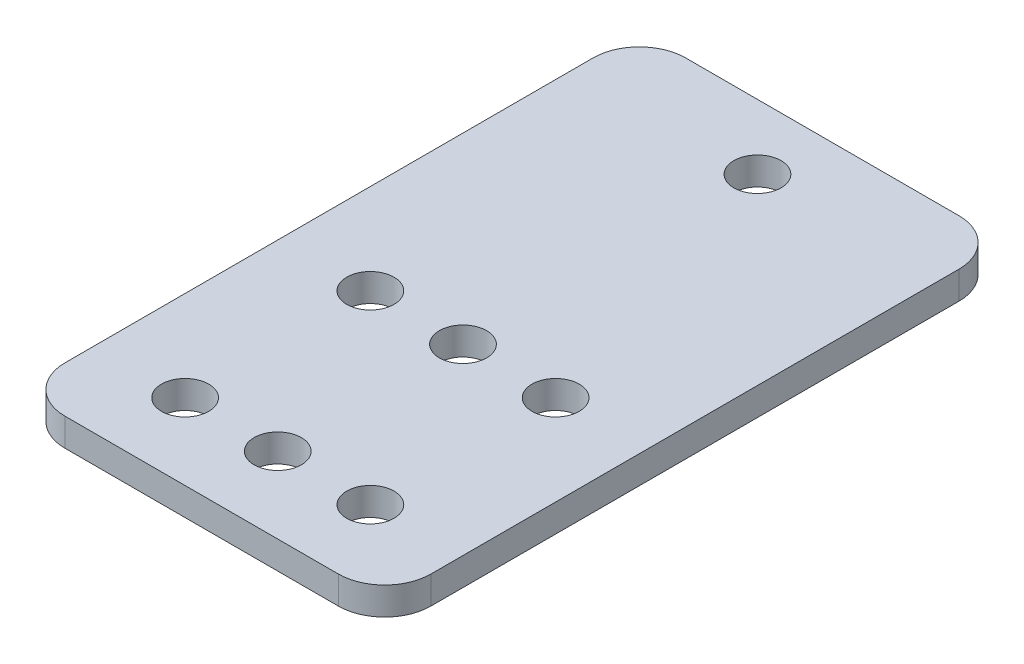
ISO-10303-21;
HEADER;
FILE_DESCRIPTION(('STEP AP214'),'2;1');
FILE_NAME('part.step','',(''),(''),'','','');
FILE_SCHEMA(('AUTOMOTIVE_DESIGN { 1 0 10303 214 1 1 1 1 }'));
ENDSEC;
DATA;
#1=APPLICATION_CONTEXT('core data for automotive mechanical design processes');
#2=APPLICATION_PROTOCOL_DEFINITION('international standard','automotive_design',2000,#1);
#3=PRODUCT_CONTEXT('',#1,'mechanical');
#4=PRODUCT('Part','Part','',(#3));
#5=PRODUCT_RELATED_PRODUCT_CATEGORY('part','',(#4));
#6=PRODUCT_DEFINITION_FORMATION('','',#4);
#7=PRODUCT_DEFINITION_CONTEXT('part definition',#1,'design');
#8=PRODUCT_DEFINITION('design','',#6,#7);
#9=PRODUCT_DEFINITION_SHAPE('','',#8);
#10=(LENGTH_UNIT() NAMED_UNIT(*) SI_UNIT(.MILLI.,.METRE.));
#11=(NAMED_UNIT(*) PLANE_ANGLE_UNIT() SI_UNIT($,.RADIAN.));
#12=(NAMED_UNIT(*) SI_UNIT($,.STERADIAN.) SOLID_ANGLE_UNIT());
#13=UNCERTAINTY_MEASURE_WITH_UNIT(LENGTH_MEASURE(1.E-05),#10,'distance_accuracy_value','');
#14=(GEOMETRIC_REPRESENTATION_CONTEXT(3) GLOBAL_UNCERTAINTY_ASSIGNED_CONTEXT((#13)) GLOBAL_UNIT_ASSIGNED_CONTEXT((#10,
#11,#12)) REPRESENTATION_CONTEXT('',''));
#15=CARTESIAN_POINT('',(0.,0.,0.));
#16=DIRECTION('',(0.,0.,1.));
#17=DIRECTION('',(1.,0.,0.));
#18=AXIS2_PLACEMENT_3D('',#15,#16,#17);
#19=CARTESIAN_POINT('',(-14.75,3.,28.5));
#20=DIRECTION('',(0.,-1.,0.));
#21=DIRECTION('',(0.,0.,-1.));
#22=AXIS2_PLACEMENT_3D('',#19,#20,#21);
#23=PLANE('',#22);
#24=CARTESIAN_POINT('',(-9.99999999999999,3.,25.29));
#25=DIRECTION('',(0.,1.,0.));
#26=DIRECTION('',(0.,0.,1.));
#27=AXIS2_PLACEMENT_3D('',#24,#25,#26);
#28=CIRCLE('',#27,2.55);
#29=CARTESIAN_POINT('',(-9.99999999999999,3.,27.84));
#30=VERTEX_POINT('',#29);
#31=EDGE_CURVE('E211',#30,#30,#28,.T.);
#32=ORIENTED_EDGE('',*,*,#31,.F.);
#33=EDGE_LOOP('',(#32));
#34=FACE_BOUND('',#33,.T.);
#35=CARTESIAN_POINT('',(0.,3.,25.29));
#36=DIRECTION('',(0.,1.,0.));
#37=DIRECTION('',(0.,0.,1.));
#38=AXIS2_PLACEMENT_3D('',#35,#36,#37);
#39=CIRCLE('',#38,2.55);
#40=CARTESIAN_POINT('',(0.,3.,27.84));
#41=VERTEX_POINT('',#40);
#42=EDGE_CURVE('E199',#41,#41,#39,.T.);
#43=ORIENTED_EDGE('',*,*,#42,.F.);
#44=EDGE_LOOP('',(#43));
#45=FACE_BOUND('',#44,.T.);
#46=CARTESIAN_POINT('',(10.,3.,25.29));
#47=DIRECTION('',(0.,1.,0.));
#48=DIRECTION('',(0.,0.,1.));
#49=AXIS2_PLACEMENT_3D('',#46,#47,#48);
#50=CIRCLE('',#49,2.55);
#51=CARTESIAN_POINT('',(10.,3.,27.84));
#52=VERTEX_POINT('',#51);
#53=EDGE_CURVE('E187',#52,#52,#50,.T.);
#54=ORIENTED_EDGE('',*,*,#53,.F.);
#55=EDGE_LOOP('',(#54));
#56=FACE_BOUND('',#55,.T.);
#57=CARTESIAN_POINT('',(-14.75,3.,28.5));
#58=DIRECTION('',(0.,1.,0.));
#59=DIRECTION('',(0.,0.,-1.));
#60=AXIS2_PLACEMENT_3D('',#57,#58,#59);
#61=CIRCLE('',#60,5.);
#62=CARTESIAN_POINT('',(-19.75,3.,28.5));
#63=VERTEX_POINT('',#62);
#64=CARTESIAN_POINT('',(-14.75,3.,33.5));
#65=VERTEX_POINT('',#64);
#66=EDGE_CURVE('E150',#63,#65,#61,.T.);
#67=ORIENTED_EDGE('',*,*,#66,.T.);
#68=DIRECTION('',(1.,0.,0.));
#69=VECTOR('',#68,1.);
#70=CARTESIAN_POINT('',(14.75,3.,33.5));
#71=LINE('',#70,#69);
#72=CARTESIAN_POINT('',(14.75,3.,33.5));
#73=VERTEX_POINT('',#72);
#74=EDGE_CURVE('E98',#65,#73,#71,.T.);
#75=ORIENTED_EDGE('',*,*,#74,.T.);
#76=CARTESIAN_POINT('',(14.75,3.,28.5));
#77=DIRECTION('',(0.,1.,0.));
#78=DIRECTION('',(0.,0.,1.));
#79=AXIS2_PLACEMENT_3D('',#76,#77,#78);
#80=CIRCLE('',#79,5.00000000000001);
#81=CARTESIAN_POINT('',(19.75,3.,28.5));
#82=VERTEX_POINT('',#81);
#83=EDGE_CURVE('E165',#73,#82,#80,.T.);
#84=ORIENTED_EDGE('',*,*,#83,.T.);
#85=DIRECTION('',(0.,0.,-1.));
#86=VECTOR('',#85,1.);
#87=CARTESIAN_POINT('',(19.75,3.,28.5));
#88=LINE('',#87,#86);
#89=CARTESIAN_POINT('',(19.75,3.,-28.5));
#90=VERTEX_POINT('',#89);
#91=EDGE_CURVE('E178',#82,#90,#88,.T.);
#92=ORIENTED_EDGE('',*,*,#91,.T.);
#93=CARTESIAN_POINT('',(14.75,3.,-28.5));
#94=DIRECTION('',(0.,1.,0.));
#95=DIRECTION('',(0.,0.,1.));
#96=AXIS2_PLACEMENT_3D('',#93,#94,#95);
#97=CIRCLE('',#96,5.);
#98=CARTESIAN_POINT('',(14.75,3.,-33.5));
#99=VERTEX_POINT('',#98);
#100=EDGE_CURVE('E117',#90,#99,#97,.T.);
#101=ORIENTED_EDGE('',*,*,#100,.T.);
#102=DIRECTION('',(-1.,0.,0.));
#103=VECTOR('',#102,1.);
#104=CARTESIAN_POINT('',(14.75,3.,-33.5));
#105=LINE('',#104,#103);
#106=CARTESIAN_POINT('',(-14.75,3.,-33.5));
#107=VERTEX_POINT('',#106);
#108=EDGE_CURVE('E111',#99,#107,#105,.T.);
#109=ORIENTED_EDGE('',*,*,#108,.T.);
#110=CARTESIAN_POINT('',(-14.75,3.,-28.5));
#111=DIRECTION('',(0.,1.,0.));
#112=DIRECTION('',(0.,0.,1.));
#113=AXIS2_PLACEMENT_3D('',#110,#111,#112);
#114=CIRCLE('',#113,5.);
#115=CARTESIAN_POINT('',(-19.75,3.,-28.5));
#116=VERTEX_POINT('',#115);
#117=EDGE_CURVE('E115',#107,#116,#114,.T.);
#118=ORIENTED_EDGE('',*,*,#117,.T.);
#119=DIRECTION('',(0.,0.,1.));
#120=VECTOR('',#119,1.);
#121=CARTESIAN_POINT('',(-19.75,3.,28.5));
#122=LINE('',#121,#120);
#123=EDGE_CURVE('E55',#116,#63,#122,.T.);
#124=ORIENTED_EDGE('',*,*,#123,.T.);
#125=EDGE_LOOP('',(#67,#75,#84,#92,#101,#109,#118,#124));
#126=FACE_BOUND('',#125,.T.);
#127=CARTESIAN_POINT('',(0.,3.,-26.5));
#128=DIRECTION('',(0.,1.,0.));
#129=DIRECTION('',(0.,0.,1.));
#130=AXIS2_PLACEMENT_3D('',#127,#128,#129);
#131=CIRCLE('',#130,2.55);
#132=CARTESIAN_POINT('',(0.,3.,-23.95));
#133=VERTEX_POINT('',#132);
#134=EDGE_CURVE('E139',#133,#133,#131,.T.);
#135=ORIENTED_EDGE('',*,*,#134,.F.);
#136=EDGE_LOOP('',(#135));
#137=FACE_BOUND('',#136,.T.);
#138=CARTESIAN_POINT('',(10.,3.,5.29));
#139=DIRECTION('',(0.,1.,0.));
#140=DIRECTION('',(0.,0.,1.));
#141=AXIS2_PLACEMENT_3D('',#138,#139,#140);
#142=CIRCLE('',#141,2.55);
#143=CARTESIAN_POINT('',(10.,3.,7.84));
#144=VERTEX_POINT('',#143);
#145=EDGE_CURVE('E193',#144,#144,#142,.T.);
#146=ORIENTED_EDGE('',*,*,#145,.F.);
#147=EDGE_LOOP('',(#146));
#148=FACE_BOUND('',#147,.T.);
#149=CARTESIAN_POINT('',(0.,3.,5.29));
#150=DIRECTION('',(0.,1.,0.));
#151=DIRECTION('',(0.,0.,1.));
#152=AXIS2_PLACEMENT_3D('',#149,#150,#151);
#153=CIRCLE('',#152,2.55);
#154=CARTESIAN_POINT('',(0.,3.,7.84));
#155=VERTEX_POINT('',#154);
#156=EDGE_CURVE('E205',#155,#155,#153,.T.);
#157=ORIENTED_EDGE('',*,*,#156,.F.);
#158=EDGE_LOOP('',(#157));
#159=FACE_BOUND('',#158,.T.);
#160=CARTESIAN_POINT('',(-9.99999999999999,3.,5.29));
#161=DIRECTION('',(0.,1.,0.));
#162=DIRECTION('',(0.,0.,1.));
#163=AXIS2_PLACEMENT_3D('',#160,#161,#162);
#164=CIRCLE('',#163,2.55);
#165=CARTESIAN_POINT('',(-9.99999999999999,3.,7.84));
#166=VERTEX_POINT('',#165);
#167=EDGE_CURVE('E217',#166,#166,#164,.T.);
#168=ORIENTED_EDGE('',*,*,#167,.F.);
#169=EDGE_LOOP('',(#168));
#170=FACE_BOUND('',#169,.T.);
#171=ADVANCED_FACE('F38',(#34,#45,#56,#126,#137,#148,#159,#170),#23,.F.);
#172=CARTESIAN_POINT('',(-14.75,0.,28.5));
#173=DIRECTION('',(0.,-1.,0.));
#174=DIRECTION('',(0.,0.,-1.));
#175=AXIS2_PLACEMENT_3D('',#172,#173,#174);
#176=PLANE('',#175);
#177=CARTESIAN_POINT('',(-9.99999999999999,0.,25.29));
#178=DIRECTION('',(0.,1.,0.));
#179=DIRECTION('',(0.,0.,1.));
#180=AXIS2_PLACEMENT_3D('',#177,#178,#179);
#181=CIRCLE('',#180,2.55);
#182=CARTESIAN_POINT('',(-9.99999999999999,0.,27.84));
#183=VERTEX_POINT('',#182);
#184=EDGE_CURVE('E214',#183,#183,#181,.T.);
#185=ORIENTED_EDGE('',*,*,#184,.T.);
#186=EDGE_LOOP('',(#185));
#187=FACE_BOUND('',#186,.T.);
#188=CARTESIAN_POINT('',(0.,0.,25.29));
#189=DIRECTION('',(0.,1.,0.));
#190=DIRECTION('',(0.,0.,1.));
#191=AXIS2_PLACEMENT_3D('',#188,#189,#190);
#192=CIRCLE('',#191,2.55);
#193=CARTESIAN_POINT('',(0.,0.,27.84));
#194=VERTEX_POINT('',#193);
#195=EDGE_CURVE('E202',#194,#194,#192,.T.);
#196=ORIENTED_EDGE('',*,*,#195,.T.);
#197=EDGE_LOOP('',(#196));
#198=FACE_BOUND('',#197,.T.);
#199=CARTESIAN_POINT('',(10.,0.,25.29));
#200=DIRECTION('',(0.,1.,0.));
#201=DIRECTION('',(0.,0.,1.));
#202=AXIS2_PLACEMENT_3D('',#199,#200,#201);
#203=CIRCLE('',#202,2.55);
#204=CARTESIAN_POINT('',(10.,0.,27.84));
#205=VERTEX_POINT('',#204);
#206=EDGE_CURVE('E190',#205,#205,#203,.T.);
#207=ORIENTED_EDGE('',*,*,#206,.T.);
#208=EDGE_LOOP('',(#207));
#209=FACE_BOUND('',#208,.T.);
#210=CARTESIAN_POINT('',(-14.75,0.,28.5));
#211=DIRECTION('',(0.,1.,0.));
#212=DIRECTION('',(0.,0.,-1.));
#213=AXIS2_PLACEMENT_3D('',#210,#211,#212);
#214=CIRCLE('',#213,5.);
#215=CARTESIAN_POINT('',(-19.75,0.,28.5));
#216=VERTEX_POINT('',#215);
#217=CARTESIAN_POINT('',(-14.75,0.,33.5));
#218=VERTEX_POINT('',#217);
#219=EDGE_CURVE('E135',#216,#218,#214,.T.);
#220=ORIENTED_EDGE('',*,*,#219,.F.);
#221=DIRECTION('',(0.,0.,1.));
#222=VECTOR('',#221,1.);
#223=CARTESIAN_POINT('',(-19.75,0.,28.5));
#224=LINE('',#223,#222);
#225=CARTESIAN_POINT('',(-19.75,0.,-28.5));
#226=VERTEX_POINT('',#225);
#227=EDGE_CURVE('E90',#226,#216,#224,.T.);
#228=ORIENTED_EDGE('',*,*,#227,.F.);
#229=CARTESIAN_POINT('',(-14.75,0.,-28.5));
#230=DIRECTION('',(0.,1.,0.));
#231=DIRECTION('',(0.,0.,1.));
#232=AXIS2_PLACEMENT_3D('',#229,#230,#231);
#233=CIRCLE('',#232,5.);
#234=CARTESIAN_POINT('',(-14.75,0.,-33.5));
#235=VERTEX_POINT('',#234);
#236=EDGE_CURVE('E84',#235,#226,#233,.T.);
#237=ORIENTED_EDGE('',*,*,#236,.F.);
#238=DIRECTION('',(-1.,0.,0.));
#239=VECTOR('',#238,1.);
#240=CARTESIAN_POINT('',(14.75,0.,-33.5));
#241=LINE('',#240,#239);
#242=CARTESIAN_POINT('',(14.75,0.,-33.5));
#243=VERTEX_POINT('',#242);
#244=EDGE_CURVE('E125',#243,#235,#241,.T.);
#245=ORIENTED_EDGE('',*,*,#244,.F.);
#246=CARTESIAN_POINT('',(14.75,0.,-28.5));
#247=DIRECTION('',(0.,1.,0.));
#248=DIRECTION('',(0.,0.,1.));
#249=AXIS2_PLACEMENT_3D('',#246,#247,#248);
#250=CIRCLE('',#249,5.);
#251=CARTESIAN_POINT('',(19.75,0.,-28.5));
#252=VERTEX_POINT('',#251);
#253=EDGE_CURVE('E145',#252,#243,#250,.T.);
#254=ORIENTED_EDGE('',*,*,#253,.F.);
#255=DIRECTION('',(0.,0.,-1.));
#256=VECTOR('',#255,1.);
#257=CARTESIAN_POINT('',(19.75,0.,28.5));
#258=LINE('',#257,#256);
#259=CARTESIAN_POINT('',(19.75,0.,28.5));
#260=VERTEX_POINT('',#259);
#261=EDGE_CURVE('E143',#260,#252,#258,.T.);
#262=ORIENTED_EDGE('',*,*,#261,.F.);
#263=CARTESIAN_POINT('',(14.75,0.,28.5));
#264=DIRECTION('',(0.,1.,0.));
#265=DIRECTION('',(0.,0.,1.));
#266=AXIS2_PLACEMENT_3D('',#263,#264,#265);
#267=CIRCLE('',#266,5.00000000000001);
#268=CARTESIAN_POINT('',(14.75,0.,33.5));
#269=VERTEX_POINT('',#268);
#270=EDGE_CURVE('E141',#269,#260,#267,.T.);
#271=ORIENTED_EDGE('',*,*,#270,.F.);
#272=DIRECTION('',(1.,0.,0.));
#273=VECTOR('',#272,1.);
#274=CARTESIAN_POINT('',(14.75,0.,33.5));
#275=LINE('',#274,#273);
#276=EDGE_CURVE('E138',#218,#269,#275,.T.);
#277=ORIENTED_EDGE('',*,*,#276,.F.);
#278=EDGE_LOOP('',(#220,#228,#237,#245,#254,#262,#271,#277));
#279=FACE_BOUND('',#278,.T.);
#280=CARTESIAN_POINT('',(0.,0.,-26.5));
#281=DIRECTION('',(0.,1.,0.));
#282=DIRECTION('',(0.,0.,1.));
#283=AXIS2_PLACEMENT_3D('',#280,#281,#282);
#284=CIRCLE('',#283,2.55);
#285=CARTESIAN_POINT('',(0.,0.,-23.95));
#286=VERTEX_POINT('',#285);
#287=EDGE_CURVE('E184',#286,#286,#284,.T.);
#288=ORIENTED_EDGE('',*,*,#287,.T.);
#289=EDGE_LOOP('',(#288));
#290=FACE_BOUND('',#289,.T.);
#291=CARTESIAN_POINT('',(10.,0.,5.29));
#292=DIRECTION('',(0.,1.,0.));
#293=DIRECTION('',(0.,0.,1.));
#294=AXIS2_PLACEMENT_3D('',#291,#292,#293);
#295=CIRCLE('',#294,2.55);
#296=CARTESIAN_POINT('',(10.,0.,7.84));
#297=VERTEX_POINT('',#296);
#298=EDGE_CURVE('E196',#297,#297,#295,.T.);
#299=ORIENTED_EDGE('',*,*,#298,.T.);
#300=EDGE_LOOP('',(#299));
#301=FACE_BOUND('',#300,.T.);
#302=CARTESIAN_POINT('',(0.,0.,5.29));
#303=DIRECTION('',(0.,1.,0.));
#304=DIRECTION('',(0.,0.,1.));
#305=AXIS2_PLACEMENT_3D('',#302,#303,#304);
#306=CIRCLE('',#305,2.55);
#307=CARTESIAN_POINT('',(0.,0.,7.84));
#308=VERTEX_POINT('',#307);
#309=EDGE_CURVE('E208',#308,#308,#306,.T.);
#310=ORIENTED_EDGE('',*,*,#309,.T.);
#311=EDGE_LOOP('',(#310));
#312=FACE_BOUND('',#311,.T.);
#313=CARTESIAN_POINT('',(-9.99999999999999,0.,5.29));
#314=DIRECTION('',(0.,1.,0.));
#315=DIRECTION('',(0.,0.,1.));
#316=AXIS2_PLACEMENT_3D('',#313,#314,#315);
#317=CIRCLE('',#316,2.55);
#318=CARTESIAN_POINT('',(-9.99999999999999,0.,7.84));
#319=VERTEX_POINT('',#318);
#320=EDGE_CURVE('E220',#319,#319,#317,.T.);
#321=ORIENTED_EDGE('',*,*,#320,.T.);
#322=EDGE_LOOP('',(#321));
#323=FACE_BOUND('',#322,.T.);
#324=ADVANCED_FACE('F169',(#187,#198,#209,#279,#290,#301,#312,#323),#176,.T.);
#325=CARTESIAN_POINT('',(-14.75,3.,28.5));
#326=DIRECTION('',(0.,-1.,0.));
#327=DIRECTION('',(0.,0.,-1.));
#328=AXIS2_PLACEMENT_3D('',#325,#326,#327);
#329=CYLINDRICAL_SURFACE('',#328,5.);
#330=ORIENTED_EDGE('',*,*,#219,.T.);
#331=DIRECTION('',(0.,-1.,0.));
#332=VECTOR('',#331,1.);
#333=CARTESIAN_POINT('',(-14.75,3.,33.5));
#334=LINE('',#333,#332);
#335=EDGE_CURVE('E11',#65,#218,#334,.T.);
#336=ORIENTED_EDGE('',*,*,#335,.F.);
#337=ORIENTED_EDGE('',*,*,#66,.F.);
#338=DIRECTION('',(0.,-1.,0.));
#339=VECTOR('',#338,1.);
#340=CARTESIAN_POINT('',(-19.75,3.,28.5));
#341=LINE('',#340,#339);
#342=EDGE_CURVE('E131',#63,#216,#341,.T.);
#343=ORIENTED_EDGE('',*,*,#342,.T.);
#344=EDGE_LOOP('',(#330,#336,#337,#343));
#345=FACE_BOUND('',#344,.T.);
#346=ADVANCED_FACE('F40',(#345),#329,.T.);
#347=CARTESIAN_POINT('',(14.75,3.,33.5));
#348=DIRECTION('',(0.,0.,-1.));
#349=DIRECTION('',(-1.,0.,0.));
#350=AXIS2_PLACEMENT_3D('',#347,#348,#349);
#351=PLANE('',#350);
#352=ORIENTED_EDGE('',*,*,#276,.T.);
#353=DIRECTION('',(0.,-1.,0.));
#354=VECTOR('',#353,1.);
#355=CARTESIAN_POINT('',(14.75,3.,33.5));
#356=LINE('',#355,#354);
#357=EDGE_CURVE('E47',#73,#269,#356,.T.);
#358=ORIENTED_EDGE('',*,*,#357,.F.);
#359=ORIENTED_EDGE('',*,*,#74,.F.);
#360=ORIENTED_EDGE('',*,*,#335,.T.);
#361=EDGE_LOOP('',(#352,#358,#359,#360));
#362=FACE_BOUND('',#361,.T.);
#363=ADVANCED_FACE('F255',(#362),#351,.F.);
#364=CARTESIAN_POINT('',(14.75,3.,28.5));
#365=DIRECTION('',(0.,-1.,0.));
#366=DIRECTION('',(0.,0.,-1.));
#367=AXIS2_PLACEMENT_3D('',#364,#365,#366);
#368=CYLINDRICAL_SURFACE('',#367,5.00000000000001);
#369=ORIENTED_EDGE('',*,*,#270,.T.);
#370=DIRECTION('',(0.,-1.,0.));
#371=VECTOR('',#370,1.);
#372=CARTESIAN_POINT('',(19.75,3.,28.5));
#373=LINE('',#372,#371);
#374=EDGE_CURVE('E157',#82,#260,#373,.T.);
#375=ORIENTED_EDGE('',*,*,#374,.F.);
#376=ORIENTED_EDGE('',*,*,#83,.F.);
#377=ORIENTED_EDGE('',*,*,#357,.T.);
#378=EDGE_LOOP('',(#369,#375,#376,#377));
#379=FACE_BOUND('',#378,.T.);
#380=ADVANCED_FACE('F163',(#379),#368,.T.);
#381=CARTESIAN_POINT('',(19.75,3.,28.5));
#382=DIRECTION('',(-1.,0.,0.));
#383=DIRECTION('',(0.,0.,1.));
#384=AXIS2_PLACEMENT_3D('',#381,#382,#383);
#385=PLANE('',#384);
#386=ORIENTED_EDGE('',*,*,#261,.T.);
#387=DIRECTION('',(0.,-1.,0.));
#388=VECTOR('',#387,1.);
#389=CARTESIAN_POINT('',(19.75,3.,-28.5));
#390=LINE('',#389,#388);
#391=EDGE_CURVE('E154',#90,#252,#390,.T.);
#392=ORIENTED_EDGE('',*,*,#391,.F.);
#393=ORIENTED_EDGE('',*,*,#91,.F.);
#394=ORIENTED_EDGE('',*,*,#374,.T.);
#395=EDGE_LOOP('',(#386,#392,#393,#394));
#396=FACE_BOUND('',#395,.T.);
#397=ADVANCED_FACE('F174',(#396),#385,.F.);
#398=CARTESIAN_POINT('',(14.75,3.,-28.5));
#399=DIRECTION('',(0.,-1.,0.));
#400=DIRECTION('',(0.,0.,-1.));
#401=AXIS2_PLACEMENT_3D('',#398,#399,#400);
#402=CYLINDRICAL_SURFACE('',#401,5.);
#403=ORIENTED_EDGE('',*,*,#253,.T.);
#404=DIRECTION('',(0.,-1.,0.));
#405=VECTOR('',#404,1.);
#406=CARTESIAN_POINT('',(14.75,3.,-33.5));
#407=LINE('',#406,#405);
#408=EDGE_CURVE('E126',#99,#243,#407,.T.);
#409=ORIENTED_EDGE('',*,*,#408,.F.);
#410=ORIENTED_EDGE('',*,*,#100,.F.);
#411=ORIENTED_EDGE('',*,*,#391,.T.);
#412=EDGE_LOOP('',(#403,#409,#410,#411));
#413=FACE_BOUND('',#412,.T.);
#414=ADVANCED_FACE('F177',(#413),#402,.T.);
#415=CARTESIAN_POINT('',(14.75,3.,-33.5));
#416=DIRECTION('',(0.,0.,1.));
#417=DIRECTION('',(1.,0.,0.));
#418=AXIS2_PLACEMENT_3D('',#415,#416,#417);
#419=PLANE('',#418);
#420=ORIENTED_EDGE('',*,*,#244,.T.);
#421=DIRECTION('',(0.,-1.,0.));
#422=VECTOR('',#421,1.);
#423=CARTESIAN_POINT('',(-14.75,3.,-33.5));
#424=LINE('',#423,#422);
#425=EDGE_CURVE('E122',#107,#235,#424,.T.);
#426=ORIENTED_EDGE('',*,*,#425,.F.);
#427=ORIENTED_EDGE('',*,*,#108,.F.);
#428=ORIENTED_EDGE('',*,*,#408,.T.);
#429=EDGE_LOOP('',(#420,#426,#427,#428));
#430=FACE_BOUND('',#429,.T.);
#431=ADVANCED_FACE('F123',(#430),#419,.F.);
#432=CARTESIAN_POINT('',(-14.75,3.,-28.5));
#433=DIRECTION('',(0.,-1.,0.));
#434=DIRECTION('',(0.,0.,-1.));
#435=AXIS2_PLACEMENT_3D('',#432,#433,#434);
#436=CYLINDRICAL_SURFACE('',#435,5.);
#437=ORIENTED_EDGE('',*,*,#236,.T.);
#438=DIRECTION('',(0.,-1.,0.));
#439=VECTOR('',#438,1.);
#440=CARTESIAN_POINT('',(-19.75,3.,-28.5));
#441=LINE('',#440,#439);
#442=EDGE_CURVE('E127',#116,#226,#441,.T.);
#443=ORIENTED_EDGE('',*,*,#442,.F.);
#444=ORIENTED_EDGE('',*,*,#117,.F.);
#445=ORIENTED_EDGE('',*,*,#425,.T.);
#446=EDGE_LOOP('',(#437,#443,#444,#445));
#447=FACE_BOUND('',#446,.T.);
#448=ADVANCED_FACE('F129',(#447),#436,.T.);
#449=CARTESIAN_POINT('',(-19.75,3.,28.5));
#450=DIRECTION('',(1.,0.,0.));
#451=DIRECTION('',(0.,0.,-1.));
#452=AXIS2_PLACEMENT_3D('',#449,#450,#451);
#453=PLANE('',#452);
#454=ORIENTED_EDGE('',*,*,#227,.T.);
#455=ORIENTED_EDGE('',*,*,#342,.F.);
#456=ORIENTED_EDGE('',*,*,#123,.F.);
#457=ORIENTED_EDGE('',*,*,#442,.T.);
#458=EDGE_LOOP('',(#454,#455,#456,#457));
#459=FACE_BOUND('',#458,.T.);
#460=ADVANCED_FACE('F243',(#459),#453,.F.);
#461=CARTESIAN_POINT('',(0.,3.,-26.5));
#462=DIRECTION('',(0.,-1.,0.));
#463=DIRECTION('',(0.,0.,-1.));
#464=AXIS2_PLACEMENT_3D('',#461,#462,#463);
#465=CYLINDRICAL_SURFACE('',#464,2.55);
#466=ORIENTED_EDGE('',*,*,#134,.T.);
#467=EDGE_LOOP('',(#466));
#468=FACE_BOUND('',#467,.T.);
#469=ORIENTED_EDGE('',*,*,#287,.F.);
#470=EDGE_LOOP('',(#469));
#471=FACE_BOUND('',#470,.T.);
#472=ADVANCED_FACE('F240',(#468,#471),#465,.F.);
#473=CARTESIAN_POINT('',(10.,3.,25.29));
#474=DIRECTION('',(0.,-1.,0.));
#475=DIRECTION('',(0.,0.,-1.));
#476=AXIS2_PLACEMENT_3D('',#473,#474,#475);
#477=CYLINDRICAL_SURFACE('',#476,2.55);
#478=ORIENTED_EDGE('',*,*,#53,.T.);
#479=EDGE_LOOP('',(#478));
#480=FACE_BOUND('',#479,.T.);
#481=ORIENTED_EDGE('',*,*,#206,.F.);
#482=EDGE_LOOP('',(#481));
#483=FACE_BOUND('',#482,.T.);
#484=ADVANCED_FACE('F299',(#480,#483),#477,.F.);
#485=CARTESIAN_POINT('',(10.,3.,5.29));
#486=DIRECTION('',(0.,-1.,0.));
#487=DIRECTION('',(0.,0.,-1.));
#488=AXIS2_PLACEMENT_3D('',#485,#486,#487);
#489=CYLINDRICAL_SURFACE('',#488,2.55);
#490=ORIENTED_EDGE('',*,*,#145,.T.);
#491=EDGE_LOOP('',(#490));
#492=FACE_BOUND('',#491,.T.);
#493=ORIENTED_EDGE('',*,*,#298,.F.);
#494=EDGE_LOOP('',(#493));
#495=FACE_BOUND('',#494,.T.);
#496=ADVANCED_FACE('F307',(#492,#495),#489,.F.);
#497=CARTESIAN_POINT('',(0.,3.,25.29));
#498=DIRECTION('',(0.,-1.,0.));
#499=DIRECTION('',(0.,0.,-1.));
#500=AXIS2_PLACEMENT_3D('',#497,#498,#499);
#501=CYLINDRICAL_SURFACE('',#500,2.55);
#502=ORIENTED_EDGE('',*,*,#42,.T.);
#503=EDGE_LOOP('',(#502));
#504=FACE_BOUND('',#503,.T.);
#505=ORIENTED_EDGE('',*,*,#195,.F.);
#506=EDGE_LOOP('',(#505));
#507=FACE_BOUND('',#506,.T.);
#508=ADVANCED_FACE('F315',(#504,#507),#501,.F.);
#509=CARTESIAN_POINT('',(0.,3.,5.29));
#510=DIRECTION('',(0.,-1.,0.));
#511=DIRECTION('',(0.,0.,-1.));
#512=AXIS2_PLACEMENT_3D('',#509,#510,#511);
#513=CYLINDRICAL_SURFACE('',#512,2.55);
#514=ORIENTED_EDGE('',*,*,#156,.T.);
#515=EDGE_LOOP('',(#514));
#516=FACE_BOUND('',#515,.T.);
#517=ORIENTED_EDGE('',*,*,#309,.F.);
#518=EDGE_LOOP('',(#517));
#519=FACE_BOUND('',#518,.T.);
#520=ADVANCED_FACE('F324',(#516,#519),#513,.F.);
#521=CARTESIAN_POINT('',(-9.99999999999999,3.,25.29));
#522=DIRECTION('',(0.,-1.,0.));
#523=DIRECTION('',(0.,0.,-1.));
#524=AXIS2_PLACEMENT_3D('',#521,#522,#523);
#525=CYLINDRICAL_SURFACE('',#524,2.55);
#526=ORIENTED_EDGE('',*,*,#31,.T.);
#527=EDGE_LOOP('',(#526));
#528=FACE_BOUND('',#527,.T.);
#529=ORIENTED_EDGE('',*,*,#184,.F.);
#530=EDGE_LOOP('',(#529));
#531=FACE_BOUND('',#530,.T.);
#532=ADVANCED_FACE('F333',(#528,#531),#525,.F.);
#533=CARTESIAN_POINT('',(-9.99999999999999,3.,5.29));
#534=DIRECTION('',(0.,-1.,0.));
#535=DIRECTION('',(0.,0.,-1.));
#536=AXIS2_PLACEMENT_3D('',#533,#534,#535);
#537=CYLINDRICAL_SURFACE('',#536,2.55);
#538=ORIENTED_EDGE('',*,*,#167,.T.);
#539=EDGE_LOOP('',(#538));
#540=FACE_BOUND('',#539,.T.);
#541=ORIENTED_EDGE('',*,*,#320,.F.);
#542=EDGE_LOOP('',(#541));
#543=FACE_BOUND('',#542,.T.);
#544=ADVANCED_FACE('F226',(#540,#543),#537,.F.);
#545=CLOSED_SHELL('',(#171,#324,#346,#363,#380,#397,#414,#431,#448,#460,#472,#484,#496,#508,
#520,#532,#544));
#546=MANIFOLD_SOLID_BREP('B2',#545);
#547=ADVANCED_BREP_SHAPE_REPRESENTATION('',(#18,#546),#14);
#548=SHAPE_DEFINITION_REPRESENTATION(#9,#547);
ENDSEC;
END-ISO-10303-21;
